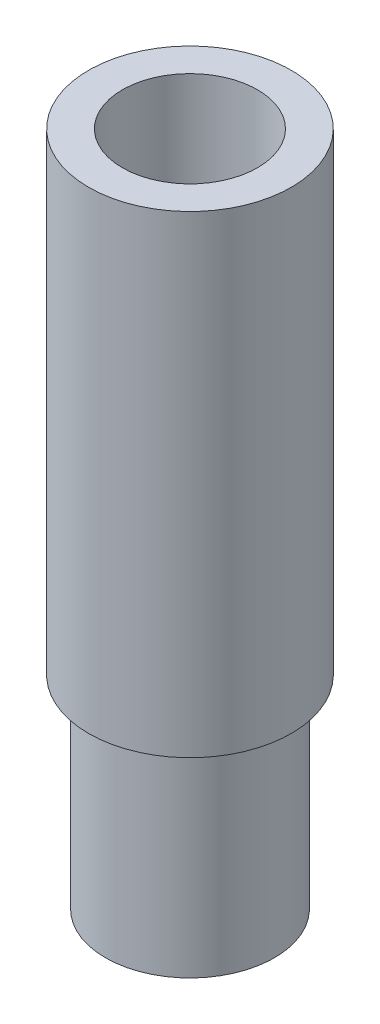
ISO-10303-21;
HEADER;
FILE_DESCRIPTION(('STEP AP214'),'2;1');
FILE_NAME('part.step','',(''),(''),'','','');
FILE_SCHEMA(('AUTOMOTIVE_DESIGN { 1 0 10303 214 1 1 1 1 }'));
ENDSEC;
DATA;
#1=APPLICATION_CONTEXT('core data for automotive mechanical design processes');
#2=APPLICATION_PROTOCOL_DEFINITION('international standard','automotive_design',2000,#1);
#3=PRODUCT_CONTEXT('',#1,'mechanical');
#4=PRODUCT('Part','Part','',(#3));
#5=PRODUCT_RELATED_PRODUCT_CATEGORY('part','',(#4));
#6=PRODUCT_DEFINITION_FORMATION('','',#4);
#7=PRODUCT_DEFINITION_CONTEXT('part definition',#1,'design');
#8=PRODUCT_DEFINITION('design','',#6,#7);
#9=PRODUCT_DEFINITION_SHAPE('','',#8);
#10=(LENGTH_UNIT() NAMED_UNIT(*) SI_UNIT(.MILLI.,.METRE.));
#11=(NAMED_UNIT(*) PLANE_ANGLE_UNIT() SI_UNIT($,.RADIAN.));
#12=(NAMED_UNIT(*) SI_UNIT($,.STERADIAN.) SOLID_ANGLE_UNIT());
#13=UNCERTAINTY_MEASURE_WITH_UNIT(LENGTH_MEASURE(1.E-05),#10,'distance_accuracy_value','');
#14=(GEOMETRIC_REPRESENTATION_CONTEXT(3) GLOBAL_UNCERTAINTY_ASSIGNED_CONTEXT((#13)) GLOBAL_UNIT_ASSIGNED_CONTEXT((#10,
#11,#12)) REPRESENTATION_CONTEXT('',''));
#15=CARTESIAN_POINT('',(0.,0.,0.));
#16=DIRECTION('',(0.,0.,1.));
#17=DIRECTION('',(1.,0.,0.));
#18=AXIS2_PLACEMENT_3D('',#15,#16,#17);
#19=CARTESIAN_POINT('',(0.,15.,0.));
#20=DIRECTION('',(0.,-1.,0.));
#21=DIRECTION('',(0.,0.,-1.));
#22=AXIS2_PLACEMENT_3D('',#19,#20,#21);
#23=CYLINDRICAL_SURFACE('',#22,6.25);
#24=CARTESIAN_POINT('',(0.,15.,0.));
#25=DIRECTION('',(0.,1.,0.));
#26=DIRECTION('',(0.,0.,1.));
#27=AXIS2_PLACEMENT_3D('',#24,#25,#26);
#28=CIRCLE('',#27,6.25);
#29=CARTESIAN_POINT('',(0.,15.,6.25));
#30=VERTEX_POINT('',#29);
#31=EDGE_CURVE('E10',#30,#30,#28,.T.);
#32=ORIENTED_EDGE('',*,*,#31,.F.);
#33=EDGE_LOOP('',(#32));
#34=FACE_BOUND('',#33,.T.);
#35=CARTESIAN_POINT('',(0.,0.,0.));
#36=DIRECTION('',(0.,1.,0.));
#37=DIRECTION('',(0.,0.,1.));
#38=AXIS2_PLACEMENT_3D('',#35,#36,#37);
#39=CIRCLE('',#38,6.25);
#40=CARTESIAN_POINT('',(0.,0.,6.25));
#41=VERTEX_POINT('',#40);
#42=EDGE_CURVE('E40',#41,#41,#39,.T.);
#43=ORIENTED_EDGE('',*,*,#42,.T.);
#44=EDGE_LOOP('',(#43));
#45=FACE_BOUND('',#44,.T.);
#46=ADVANCED_FACE('F33',(#34,#45),#23,.T.);
#47=CARTESIAN_POINT('',(0.,0.,0.));
#48=DIRECTION('',(0.,1.,0.));
#49=DIRECTION('',(0.,0.,1.));
#50=AXIS2_PLACEMENT_3D('',#47,#48,#49);
#51=PLANE('',#50);
#52=CARTESIAN_POINT('',(0.,0.,0.));
#53=DIRECTION('',(0.,-1.,0.));
#54=DIRECTION('',(0.,0.,-1.));
#55=AXIS2_PLACEMENT_3D('',#52,#53,#54);
#56=CIRCLE('',#55,2.5);
#57=CARTESIAN_POINT('',(0.,0.,-2.5));
#58=VERTEX_POINT('',#57);
#59=EDGE_CURVE('E58',#58,#58,#56,.T.);
#60=ORIENTED_EDGE('',*,*,#59,.F.);
#61=EDGE_LOOP('',(#60));
#62=FACE_BOUND('',#61,.T.);
#63=ORIENTED_EDGE('',*,*,#42,.F.);
#64=EDGE_LOOP('',(#63));
#65=FACE_BOUND('',#64,.T.);
#66=ADVANCED_FACE('F89',(#62,#65),#51,.F.);
#67=CARTESIAN_POINT('',(0.,50.,0.));
#68=DIRECTION('',(0.,-1.,0.));
#69=DIRECTION('',(0.,0.,-1.));
#70=AXIS2_PLACEMENT_3D('',#67,#68,#69);
#71=CYLINDRICAL_SURFACE('',#70,7.5);
#72=CARTESIAN_POINT('',(0.,50.,0.));
#73=DIRECTION('',(0.,1.,0.));
#74=DIRECTION('',(0.,0.,1.));
#75=AXIS2_PLACEMENT_3D('',#72,#73,#74);
#76=CIRCLE('',#75,7.5);
#77=CARTESIAN_POINT('',(0.,50.,7.5));
#78=VERTEX_POINT('',#77);
#79=EDGE_CURVE('E45',#78,#78,#76,.T.);
#80=ORIENTED_EDGE('',*,*,#79,.F.);
#81=EDGE_LOOP('',(#80));
#82=FACE_BOUND('',#81,.T.);
#83=CARTESIAN_POINT('',(0.,15.,0.));
#84=DIRECTION('',(0.,1.,0.));
#85=DIRECTION('',(0.,0.,1.));
#86=AXIS2_PLACEMENT_3D('',#83,#84,#85);
#87=CIRCLE('',#86,7.5);
#88=CARTESIAN_POINT('',(0.,15.,7.5));
#89=VERTEX_POINT('',#88);
#90=EDGE_CURVE('E47',#89,#89,#87,.T.);
#91=ORIENTED_EDGE('',*,*,#90,.T.);
#92=EDGE_LOOP('',(#91));
#93=FACE_BOUND('',#92,.T.);
#94=ADVANCED_FACE('F83',(#82,#93),#71,.T.);
#95=CARTESIAN_POINT('',(0.,50.,0.));
#96=DIRECTION('',(0.,1.,0.));
#97=DIRECTION('',(0.,0.,1.));
#98=AXIS2_PLACEMENT_3D('',#95,#96,#97);
#99=PLANE('',#98);
#100=CARTESIAN_POINT('',(0.,50.,0.));
#101=DIRECTION('',(0.,1.,0.));
#102=DIRECTION('',(0.,0.,1.));
#103=AXIS2_PLACEMENT_3D('',#100,#101,#102);
#104=CIRCLE('',#103,5.);
#105=CARTESIAN_POINT('',(0.,50.,5.));
#106=VERTEX_POINT('',#105);
#107=EDGE_CURVE('E53',#106,#106,#104,.T.);
#108=ORIENTED_EDGE('',*,*,#107,.F.);
#109=EDGE_LOOP('',(#108));
#110=FACE_BOUND('',#109,.T.);
#111=ORIENTED_EDGE('',*,*,#79,.T.);
#112=EDGE_LOOP('',(#111));
#113=FACE_BOUND('',#112,.T.);
#114=ADVANCED_FACE('F80',(#110,#113),#99,.T.);
#115=CARTESIAN_POINT('',(0.,15.,0.));
#116=DIRECTION('',(0.,1.,0.));
#117=DIRECTION('',(0.,0.,1.));
#118=AXIS2_PLACEMENT_3D('',#115,#116,#117);
#119=PLANE('',#118);
#120=ORIENTED_EDGE('',*,*,#31,.T.);
#121=EDGE_LOOP('',(#120));
#122=FACE_BOUND('',#121,.T.);
#123=ORIENTED_EDGE('',*,*,#90,.F.);
#124=EDGE_LOOP('',(#123));
#125=FACE_BOUND('',#124,.T.);
#126=ADVANCED_FACE('F76',(#122,#125),#119,.F.);
#127=CARTESIAN_POINT('',(0.,25.,0.));
#128=DIRECTION('',(0.,1.,0.));
#129=DIRECTION('',(0.,0.,1.));
#130=AXIS2_PLACEMENT_3D('',#127,#128,#129);
#131=CYLINDRICAL_SURFACE('',#130,5.);
#132=CARTESIAN_POINT('',(0.,25.,0.));
#133=DIRECTION('',(0.,1.,0.));
#134=DIRECTION('',(0.,0.,1.));
#135=AXIS2_PLACEMENT_3D('',#132,#133,#134);
#136=CIRCLE('',#135,5.);
#137=CARTESIAN_POINT('',(0.,25.,5.));
#138=VERTEX_POINT('',#137);
#139=EDGE_CURVE('E50',#138,#138,#136,.T.);
#140=ORIENTED_EDGE('',*,*,#139,.F.);
#141=EDGE_LOOP('',(#140));
#142=FACE_BOUND('',#141,.T.);
#143=ORIENTED_EDGE('',*,*,#107,.T.);
#144=EDGE_LOOP('',(#143));
#145=FACE_BOUND('',#144,.T.);
#146=ADVANCED_FACE('F70',(#142,#145),#131,.F.);
#147=CARTESIAN_POINT('',(0.,25.,0.));
#148=DIRECTION('',(0.,1.,0.));
#149=DIRECTION('',(0.,0.,1.));
#150=AXIS2_PLACEMENT_3D('',#147,#148,#149);
#151=PLANE('',#150);
#152=CARTESIAN_POINT('',(0.,25.,0.));
#153=DIRECTION('',(0.,1.,0.));
#154=DIRECTION('',(0.,0.,1.));
#155=AXIS2_PLACEMENT_3D('',#152,#153,#154);
#156=CIRCLE('',#155,2.5);
#157=CARTESIAN_POINT('',(0.,25.,2.5));
#158=VERTEX_POINT('',#157);
#159=EDGE_CURVE('E36',#158,#158,#156,.T.);
#160=ORIENTED_EDGE('',*,*,#159,.F.);
#161=EDGE_LOOP('',(#160));
#162=FACE_BOUND('',#161,.T.);
#163=ORIENTED_EDGE('',*,*,#139,.T.);
#164=EDGE_LOOP('',(#163));
#165=FACE_BOUND('',#164,.T.);
#166=ADVANCED_FACE('F67',(#162,#165),#151,.T.);
#167=CARTESIAN_POINT('',(0.,35.,0.));
#168=DIRECTION('',(0.,-1.,0.));
#169=DIRECTION('',(0.,0.,-1.));
#170=AXIS2_PLACEMENT_3D('',#167,#168,#169);
#171=CYLINDRICAL_SURFACE('',#170,2.5);
#172=ORIENTED_EDGE('',*,*,#159,.T.);
#173=EDGE_LOOP('',(#172));
#174=FACE_BOUND('',#173,.T.);
#175=ORIENTED_EDGE('',*,*,#59,.T.);
#176=EDGE_LOOP('',(#175));
#177=FACE_BOUND('',#176,.T.);
#178=ADVANCED_FACE('F65',(#174,#177),#171,.F.);
#179=CLOSED_SHELL('',(#46,#66,#94,#114,#126,#146,#166,#178));
#180=MANIFOLD_SOLID_BREP('B2',#179);
#181=ADVANCED_BREP_SHAPE_REPRESENTATION('',(#18,#180),#14);
#182=SHAPE_DEFINITION_REPRESENTATION(#9,#181);
ENDSEC;
END-ISO-10303-21;
